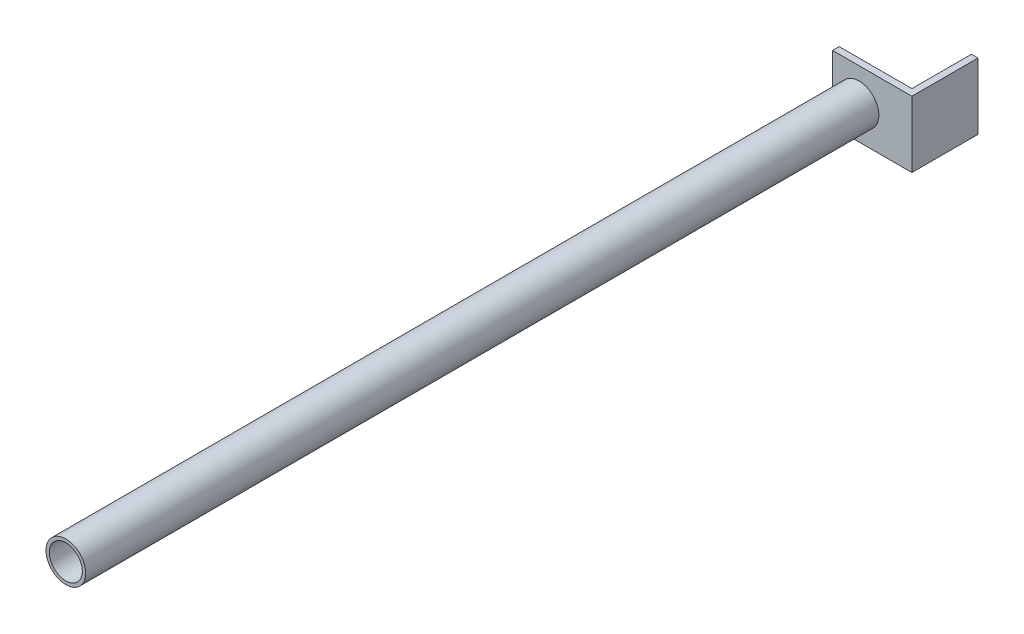
ISO-10303-21;
HEADER;
FILE_DESCRIPTION(('STEP AP214'),'2;1');
FILE_NAME('part.step','',(''),(''),'','','');
FILE_SCHEMA(('AUTOMOTIVE_DESIGN { 1 0 10303 214 1 1 1 1 }'));
ENDSEC;
DATA;
#1=APPLICATION_CONTEXT('core data for automotive mechanical design processes');
#2=APPLICATION_PROTOCOL_DEFINITION('international standard','automotive_design',2000,#1);
#3=PRODUCT_CONTEXT('',#1,'mechanical');
#4=PRODUCT('Part','Part','',(#3));
#5=PRODUCT_RELATED_PRODUCT_CATEGORY('part','',(#4));
#6=PRODUCT_DEFINITION_FORMATION('','',#4);
#7=PRODUCT_DEFINITION_CONTEXT('part definition',#1,'design');
#8=PRODUCT_DEFINITION('design','',#6,#7);
#9=PRODUCT_DEFINITION_SHAPE('','',#8);
#10=(LENGTH_UNIT() NAMED_UNIT(*) SI_UNIT(.MILLI.,.METRE.));
#11=(NAMED_UNIT(*) PLANE_ANGLE_UNIT() SI_UNIT($,.RADIAN.));
#12=(NAMED_UNIT(*) SI_UNIT($,.STERADIAN.) SOLID_ANGLE_UNIT());
#13=UNCERTAINTY_MEASURE_WITH_UNIT(LENGTH_MEASURE(1.E-05),#10,'distance_accuracy_value','');
#14=(GEOMETRIC_REPRESENTATION_CONTEXT(3) GLOBAL_UNCERTAINTY_ASSIGNED_CONTEXT((#13)) GLOBAL_UNIT_ASSIGNED_CONTEXT((#10,
#11,#12)) REPRESENTATION_CONTEXT('',''));
#15=CARTESIAN_POINT('',(0.,0.,0.));
#16=DIRECTION('',(0.,0.,1.));
#17=DIRECTION('',(1.,0.,0.));
#18=AXIS2_PLACEMENT_3D('',#15,#16,#17);
#19=CARTESIAN_POINT('',(0.,31.75,31.75));
#20=DIRECTION('',(0.,0.,-1.));
#21=DIRECTION('',(-1.,0.,0.));
#22=AXIS2_PLACEMENT_3D('',#19,#20,#21);
#23=PLANE('',#22);
#24=DIRECTION('',(1.,0.,0.));
#25=VECTOR('',#24,1.);
#26=CARTESIAN_POINT('',(0.,-31.75,31.75));
#27=LINE('',#26,#25);
#28=CARTESIAN_POINT('',(-76.2,-31.75,31.75));
#29=VERTEX_POINT('',#28);
#30=CARTESIAN_POINT('',(0.,-31.75,31.75));
#31=VERTEX_POINT('',#30);
#32=EDGE_CURVE('E84',#29,#31,#27,.T.);
#33=ORIENTED_EDGE('',*,*,#32,.T.);
#34=DIRECTION('',(0.,-1.,0.));
#35=VECTOR('',#34,1.);
#36=CARTESIAN_POINT('',(0.,31.75,31.75));
#37=LINE('',#36,#35);
#38=CARTESIAN_POINT('',(0.,31.75,31.75));
#39=VERTEX_POINT('',#38);
#40=EDGE_CURVE('E126',#39,#31,#37,.T.);
#41=ORIENTED_EDGE('',*,*,#40,.F.);
#42=DIRECTION('',(1.,0.,0.));
#43=VECTOR('',#42,1.);
#44=CARTESIAN_POINT('',(0.,31.75,31.75));
#45=LINE('',#44,#43);
#46=CARTESIAN_POINT('',(-76.2,31.75,31.75));
#47=VERTEX_POINT('',#46);
#48=EDGE_CURVE('E112',#47,#39,#45,.T.);
#49=ORIENTED_EDGE('',*,*,#48,.F.);
#50=DIRECTION('',(0.,-1.,0.));
#51=VECTOR('',#50,1.);
#52=CARTESIAN_POINT('',(-76.2,31.75,31.75));
#53=LINE('',#52,#51);
#54=EDGE_CURVE('E120',#47,#29,#53,.T.);
#55=ORIENTED_EDGE('',*,*,#54,.T.);
#56=EDGE_LOOP('',(#33,#41,#49,#55));
#57=FACE_BOUND('',#56,.T.);
#58=CARTESIAN_POINT('',(-50.8,0.,31.7499999999999));
#59=DIRECTION('',(0.,0.,-1.));
#60=DIRECTION('',(-1.,0.,0.));
#61=AXIS2_PLACEMENT_3D('',#58,#59,#60);
#62=CIRCLE('',#61,19.05);
#63=CARTESIAN_POINT('',(-69.85,0.,31.7499999999999));
#64=VERTEX_POINT('',#63);
#65=EDGE_CURVE('E11',#64,#64,#62,.F.);
#66=ORIENTED_EDGE('',*,*,#65,.F.);
#67=EDGE_LOOP('',(#66));
#68=FACE_BOUND('',#67,.T.);
#69=ADVANCED_FACE('F37',(#57,#68),#23,.F.);
#70=CARTESIAN_POINT('',(-6.35,31.75,-31.75));
#71=DIRECTION('',(0.,0.,1.));
#72=DIRECTION('',(1.,0.,0.));
#73=AXIS2_PLACEMENT_3D('',#70,#71,#72);
#74=PLANE('',#73);
#75=DIRECTION('',(-1.,0.,0.));
#76=VECTOR('',#75,1.);
#77=CARTESIAN_POINT('',(-6.35,-31.75,-31.75));
#78=LINE('',#77,#76);
#79=CARTESIAN_POINT('',(0.,-31.75,-31.75));
#80=VERTEX_POINT('',#79);
#81=CARTESIAN_POINT('',(-6.35,-31.75,-31.75));
#82=VERTEX_POINT('',#81);
#83=EDGE_CURVE('E136',#80,#82,#78,.T.);
#84=ORIENTED_EDGE('',*,*,#83,.T.);
#85=DIRECTION('',(0.,-1.,0.));
#86=VECTOR('',#85,1.);
#87=CARTESIAN_POINT('',(-6.35,31.75,-31.75));
#88=LINE('',#87,#86);
#89=CARTESIAN_POINT('',(-6.35,31.75,-31.75));
#90=VERTEX_POINT('',#89);
#91=EDGE_CURVE('E47',#90,#82,#88,.T.);
#92=ORIENTED_EDGE('',*,*,#91,.F.);
#93=DIRECTION('',(-1.,0.,0.));
#94=VECTOR('',#93,1.);
#95=CARTESIAN_POINT('',(-6.35,31.75,-31.75));
#96=LINE('',#95,#94);
#97=CARTESIAN_POINT('',(0.,31.75,-31.75));
#98=VERTEX_POINT('',#97);
#99=EDGE_CURVE('E153',#98,#90,#96,.T.);
#100=ORIENTED_EDGE('',*,*,#99,.F.);
#101=DIRECTION('',(0.,-1.,0.));
#102=VECTOR('',#101,1.);
#103=CARTESIAN_POINT('',(0.,31.75,-31.75));
#104=LINE('',#103,#102);
#105=EDGE_CURVE('E132',#98,#80,#104,.T.);
#106=ORIENTED_EDGE('',*,*,#105,.T.);
#107=EDGE_LOOP('',(#84,#92,#100,#106));
#108=FACE_BOUND('',#107,.T.);
#109=ADVANCED_FACE('F39',(#108),#74,.F.);
#110=CARTESIAN_POINT('',(-6.34999999999999,31.75,25.4));
#111=DIRECTION('',(1.,0.,0.));
#112=DIRECTION('',(0.,0.,-1.));
#113=AXIS2_PLACEMENT_3D('',#110,#111,#112);
#114=PLANE('',#113);
#115=DIRECTION('',(0.,0.,1.));
#116=VECTOR('',#115,1.);
#117=CARTESIAN_POINT('',(-6.34999999999999,-31.75,25.4));
#118=LINE('',#117,#116);
#119=CARTESIAN_POINT('',(-6.34999999999999,-31.75,25.4));
#120=VERTEX_POINT('',#119);
#121=EDGE_CURVE('E140',#82,#120,#118,.T.);
#122=ORIENTED_EDGE('',*,*,#121,.T.);
#123=DIRECTION('',(0.,-1.,0.));
#124=VECTOR('',#123,1.);
#125=CARTESIAN_POINT('',(-6.34999999999999,31.75,25.4));
#126=LINE('',#125,#124);
#127=CARTESIAN_POINT('',(-6.34999999999999,31.75,25.4));
#128=VERTEX_POINT('',#127);
#129=EDGE_CURVE('E160',#128,#120,#126,.T.);
#130=ORIENTED_EDGE('',*,*,#129,.F.);
#131=DIRECTION('',(0.,0.,1.));
#132=VECTOR('',#131,1.);
#133=CARTESIAN_POINT('',(-6.34999999999999,31.75,25.4));
#134=LINE('',#133,#132);
#135=EDGE_CURVE('E99',#90,#128,#134,.T.);
#136=ORIENTED_EDGE('',*,*,#135,.F.);
#137=ORIENTED_EDGE('',*,*,#91,.T.);
#138=EDGE_LOOP('',(#122,#130,#136,#137));
#139=FACE_BOUND('',#138,.T.);
#140=ADVANCED_FACE('F166',(#139),#114,.F.);
#141=CARTESIAN_POINT('',(-76.2,31.75,25.4));
#142=DIRECTION('',(0.,0.,1.));
#143=DIRECTION('',(1.,0.,0.));
#144=AXIS2_PLACEMENT_3D('',#141,#142,#143);
#145=PLANE('',#144);
#146=DIRECTION('',(-1.,0.,0.));
#147=VECTOR('',#146,1.);
#148=CARTESIAN_POINT('',(-76.2,-31.75,25.4));
#149=LINE('',#148,#147);
#150=CARTESIAN_POINT('',(-76.2,-31.75,25.4));
#151=VERTEX_POINT('',#150);
#152=EDGE_CURVE('E144',#120,#151,#149,.T.);
#153=ORIENTED_EDGE('',*,*,#152,.T.);
#154=DIRECTION('',(0.,-1.,0.));
#155=VECTOR('',#154,1.);
#156=CARTESIAN_POINT('',(-76.2,31.75,25.4));
#157=LINE('',#156,#155);
#158=CARTESIAN_POINT('',(-76.2,31.75,25.4));
#159=VERTEX_POINT('',#158);
#160=EDGE_CURVE('E125',#159,#151,#157,.T.);
#161=ORIENTED_EDGE('',*,*,#160,.F.);
#162=DIRECTION('',(-1.,0.,0.));
#163=VECTOR('',#162,1.);
#164=CARTESIAN_POINT('',(-76.2,31.75,25.4));
#165=LINE('',#164,#163);
#166=EDGE_CURVE('E114',#128,#159,#165,.T.);
#167=ORIENTED_EDGE('',*,*,#166,.F.);
#168=ORIENTED_EDGE('',*,*,#129,.T.);
#169=EDGE_LOOP('',(#153,#161,#167,#168));
#170=FACE_BOUND('',#169,.T.);
#171=ADVANCED_FACE('F174',(#170),#145,.F.);
#172=CARTESIAN_POINT('',(-76.2,31.75,31.75));
#173=DIRECTION('',(1.,0.,0.));
#174=DIRECTION('',(0.,0.,-1.));
#175=AXIS2_PLACEMENT_3D('',#172,#173,#174);
#176=PLANE('',#175);
#177=DIRECTION('',(0.,0.,1.));
#178=VECTOR('',#177,1.);
#179=CARTESIAN_POINT('',(-76.2,-31.75,31.75));
#180=LINE('',#179,#178);
#181=EDGE_CURVE('E123',#151,#29,#180,.T.);
#182=ORIENTED_EDGE('',*,*,#181,.T.);
#183=ORIENTED_EDGE('',*,*,#54,.F.);
#184=DIRECTION('',(0.,0.,1.));
#185=VECTOR('',#184,1.);
#186=CARTESIAN_POINT('',(-76.2,31.75,31.75));
#187=LINE('',#186,#185);
#188=EDGE_CURVE('E108',#159,#47,#187,.T.);
#189=ORIENTED_EDGE('',*,*,#188,.F.);
#190=ORIENTED_EDGE('',*,*,#160,.T.);
#191=EDGE_LOOP('',(#182,#183,#189,#190));
#192=FACE_BOUND('',#191,.T.);
#193=ADVANCED_FACE('F121',(#192),#176,.F.);
#194=CARTESIAN_POINT('',(0.,31.75,-31.75));
#195=DIRECTION('',(-1.,0.,0.));
#196=DIRECTION('',(0.,0.,1.));
#197=AXIS2_PLACEMENT_3D('',#194,#195,#196);
#198=PLANE('',#197);
#199=DIRECTION('',(0.,0.,-1.));
#200=VECTOR('',#199,1.);
#201=CARTESIAN_POINT('',(0.,-31.75,-31.75));
#202=LINE('',#201,#200);
#203=EDGE_CURVE('E90',#31,#80,#202,.T.);
#204=ORIENTED_EDGE('',*,*,#203,.T.);
#205=ORIENTED_EDGE('',*,*,#105,.F.);
#206=DIRECTION('',(0.,0.,-1.));
#207=VECTOR('',#206,1.);
#208=CARTESIAN_POINT('',(0.,31.75,-31.75));
#209=LINE('',#208,#207);
#210=EDGE_CURVE('E55',#39,#98,#209,.T.);
#211=ORIENTED_EDGE('',*,*,#210,.F.);
#212=ORIENTED_EDGE('',*,*,#40,.T.);
#213=EDGE_LOOP('',(#204,#205,#211,#212));
#214=FACE_BOUND('',#213,.T.);
#215=ADVANCED_FACE('F243',(#214),#198,.F.);
#216=CARTESIAN_POINT('',(0.,31.75,-31.75));
#217=DIRECTION('',(0.,-1.,0.));
#218=DIRECTION('',(0.,0.,-1.));
#219=AXIS2_PLACEMENT_3D('',#216,#217,#218);
#220=PLANE('',#219);
#221=ORIENTED_EDGE('',*,*,#99,.T.);
#222=ORIENTED_EDGE('',*,*,#135,.T.);
#223=ORIENTED_EDGE('',*,*,#166,.T.);
#224=ORIENTED_EDGE('',*,*,#188,.T.);
#225=ORIENTED_EDGE('',*,*,#48,.T.);
#226=ORIENTED_EDGE('',*,*,#210,.T.);
#227=EDGE_LOOP('',(#221,#222,#223,#224,#225,#226));
#228=FACE_BOUND('',#227,.T.);
#229=ADVANCED_FACE('F110',(#228),#220,.F.);
#230=CARTESIAN_POINT('',(0.,-31.75,-31.75));
#231=DIRECTION('',(0.,-1.,0.));
#232=DIRECTION('',(0.,0.,-1.));
#233=AXIS2_PLACEMENT_3D('',#230,#231,#232);
#234=PLANE('',#233);
#235=ORIENTED_EDGE('',*,*,#83,.F.);
#236=ORIENTED_EDGE('',*,*,#203,.F.);
#237=ORIENTED_EDGE('',*,*,#32,.F.);
#238=ORIENTED_EDGE('',*,*,#181,.F.);
#239=ORIENTED_EDGE('',*,*,#152,.F.);
#240=ORIENTED_EDGE('',*,*,#121,.F.);
#241=EDGE_LOOP('',(#235,#236,#237,#238,#239,#240));
#242=FACE_BOUND('',#241,.T.);
#243=ADVANCED_FACE('F171',(#242),#234,.T.);
#244=CARTESIAN_POINT('',(-50.8,0.,793.75));
#245=DIRECTION('',(0.,0.,1.));
#246=DIRECTION('',(1.,0.,0.));
#247=AXIS2_PLACEMENT_3D('',#244,#245,#246);
#248=PLANE('',#247);
#249=CARTESIAN_POINT('',(-50.8,0.,793.75));
#250=DIRECTION('',(0.,0.,1.));
#251=DIRECTION('',(1.,0.,0.));
#252=AXIS2_PLACEMENT_3D('',#249,#250,#251);
#253=CIRCLE('',#252,19.05);
#254=CARTESIAN_POINT('',(-31.75,0.,793.75));
#255=VERTEX_POINT('',#254);
#256=EDGE_CURVE('E141',#255,#255,#253,.T.);
#257=ORIENTED_EDGE('',*,*,#256,.T.);
#258=EDGE_LOOP('',(#257));
#259=FACE_BOUND('',#258,.T.);
#260=CARTESIAN_POINT('',(-50.8,0.,793.75));
#261=DIRECTION('',(0.,0.,1.));
#262=DIRECTION('',(1.,0.,0.));
#263=AXIS2_PLACEMENT_3D('',#260,#261,#262);
#264=CIRCLE('',#263,15.875);
#265=CARTESIAN_POINT('',(-34.925,0.,793.75));
#266=VERTEX_POINT('',#265);
#267=EDGE_CURVE('E180',#266,#266,#264,.T.);
#268=ORIENTED_EDGE('',*,*,#267,.F.);
#269=EDGE_LOOP('',(#268));
#270=FACE_BOUND('',#269,.T.);
#271=ADVANCED_FACE('F190',(#259,#270),#248,.T.);
#272=CARTESIAN_POINT('',(-50.8,0.,793.75));
#273=DIRECTION('',(0.,0.,-1.));
#274=DIRECTION('',(-1.,0.,0.));
#275=AXIS2_PLACEMENT_3D('',#272,#273,#274);
#276=CYLINDRICAL_SURFACE('',#275,19.05);
#277=ORIENTED_EDGE('',*,*,#256,.F.);
#278=EDGE_LOOP('',(#277));
#279=FACE_BOUND('',#278,.T.);
#280=ORIENTED_EDGE('',*,*,#65,.T.);
#281=EDGE_LOOP('',(#280));
#282=FACE_BOUND('',#281,.T.);
#283=ADVANCED_FACE('F192',(#279,#282),#276,.T.);
#284=CARTESIAN_POINT('',(-50.8,0.,793.75));
#285=DIRECTION('',(0.,0.,-1.));
#286=DIRECTION('',(-1.,0.,0.));
#287=AXIS2_PLACEMENT_3D('',#284,#285,#286);
#288=CYLINDRICAL_SURFACE('',#287,15.875);
#289=ORIENTED_EDGE('',*,*,#267,.T.);
#290=EDGE_LOOP('',(#289));
#291=FACE_BOUND('',#290,.T.);
#292=CARTESIAN_POINT('',(-50.8,0.,31.75));
#293=DIRECTION('',(0.,0.,1.));
#294=DIRECTION('',(1.,0.,0.));
#295=AXIS2_PLACEMENT_3D('',#292,#293,#294);
#296=CIRCLE('',#295,15.875);
#297=CARTESIAN_POINT('',(-34.925,0.,31.75));
#298=VERTEX_POINT('',#297);
#299=EDGE_CURVE('E181',#298,#298,#296,.T.);
#300=ORIENTED_EDGE('',*,*,#299,.F.);
#301=EDGE_LOOP('',(#300));
#302=FACE_BOUND('',#301,.T.);
#303=ADVANCED_FACE('F187',(#291,#302),#288,.F.);
#304=ORIENTED_EDGE('',*,*,#299,.T.);
#305=EDGE_LOOP('',(#304));
#306=FACE_BOUND('',#305,.T.);
#307=ADVANCED_FACE('F205',(#306),#23,.F.);
#308=CLOSED_SHELL('',(#69,#109,#140,#171,#193,#215,#229,#243,#271,#283,#303,#307));
#309=MANIFOLD_SOLID_BREP('B2',#308);
#310=ADVANCED_BREP_SHAPE_REPRESENTATION('',(#18,#309),#14);
#311=SHAPE_DEFINITION_REPRESENTATION(#9,#310);
ENDSEC;
END-ISO-10303-21;
